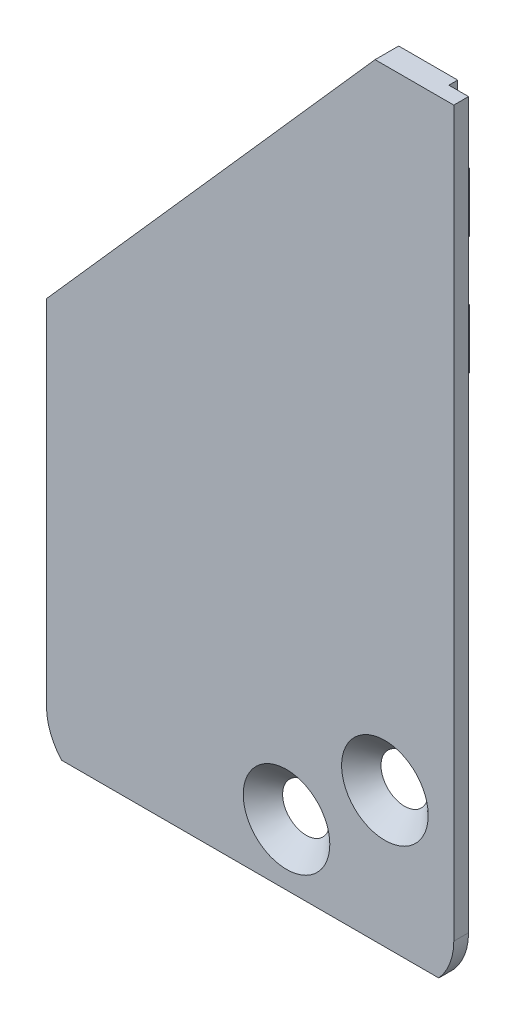
ISO-10303-21;
HEADER;
FILE_DESCRIPTION(('STEP AP214'),'2;1');
FILE_NAME('part.step','',(''),(''),'','','');
FILE_SCHEMA(('AUTOMOTIVE_DESIGN { 1 0 10303 214 1 1 1 1 }'));
ENDSEC;
DATA;
#1=APPLICATION_CONTEXT('core data for automotive mechanical design processes');
#2=APPLICATION_PROTOCOL_DEFINITION('international standard','automotive_design',2000,#1);
#3=PRODUCT_CONTEXT('',#1,'mechanical');
#4=PRODUCT('Part','Part','',(#3));
#5=PRODUCT_RELATED_PRODUCT_CATEGORY('part','',(#4));
#6=PRODUCT_DEFINITION_FORMATION('','',#4);
#7=PRODUCT_DEFINITION_CONTEXT('part definition',#1,'design');
#8=PRODUCT_DEFINITION('design','',#6,#7);
#9=PRODUCT_DEFINITION_SHAPE('','',#8);
#10=(LENGTH_UNIT() NAMED_UNIT(*) SI_UNIT(.MILLI.,.METRE.));
#11=(NAMED_UNIT(*) PLANE_ANGLE_UNIT() SI_UNIT($,.RADIAN.));
#12=(NAMED_UNIT(*) SI_UNIT($,.STERADIAN.) SOLID_ANGLE_UNIT());
#13=UNCERTAINTY_MEASURE_WITH_UNIT(LENGTH_MEASURE(1.E-05),#10,'distance_accuracy_value','');
#14=(GEOMETRIC_REPRESENTATION_CONTEXT(3) GLOBAL_UNCERTAINTY_ASSIGNED_CONTEXT((#13)) GLOBAL_UNIT_ASSIGNED_CONTEXT((#10,
#11,#12)) REPRESENTATION_CONTEXT('',''));
#15=CARTESIAN_POINT('',(0.,0.,0.));
#16=DIRECTION('',(0.,0.,1.));
#17=DIRECTION('',(1.,0.,0.));
#18=AXIS2_PLACEMENT_3D('',#15,#16,#17);
#19=CARTESIAN_POINT('',(13.2550598483893,0.,-0.8));
#20=DIRECTION('',(-1.,0.,0.));
#21=DIRECTION('',(0.,-1.,0.));
#22=AXIS2_PLACEMENT_3D('',#19,#20,#21);
#23=PLANE('',#22);
#24=DIRECTION('',(0.,1.,0.));
#25=VECTOR('',#24,1.);
#26=CARTESIAN_POINT('',(13.2550598483893,0.,0.25));
#27=LINE('',#26,#25);
#28=CARTESIAN_POINT('',(13.2550598483894,21.1086005393354,0.25));
#29=VERTEX_POINT('',#28);
#30=CARTESIAN_POINT('',(13.2550598484106,57.9086005393351,0.25));
#31=VERTEX_POINT('',#30);
#32=EDGE_CURVE('E251',#29,#31,#27,.T.);
#33=ORIENTED_EDGE('',*,*,#32,.F.);
#34=DIRECTION('',(0.,0.,1.));
#35=VECTOR('',#34,1.);
#36=CARTESIAN_POINT('',(13.2550598483894,21.1086005393354,-0.2));
#37=LINE('',#36,#35);
#38=CARTESIAN_POINT('',(13.2550598484169,21.1086005393354,0.));
#39=VERTEX_POINT('',#38);
#40=EDGE_CURVE('E368',#29,#39,#37,.F.);
#41=ORIENTED_EDGE('',*,*,#40,.T.);
#42=DIRECTION('',(0.,-1.,0.));
#43=VECTOR('',#42,1.);
#44=CARTESIAN_POINT('',(13.2550598484169,33.2336005393516,0.));
#45=LINE('',#44,#43);
#46=CARTESIAN_POINT('',(13.2550598484169,33.2336005393516,0.));
#47=VERTEX_POINT('',#46);
#48=EDGE_CURVE('E271',#47,#39,#45,.T.);
#49=ORIENTED_EDGE('',*,*,#48,.F.);
#50=DIRECTION('',(0.,0.,1.));
#51=VECTOR('',#50,1.);
#52=CARTESIAN_POINT('',(13.2550598484169,33.2336005393516,-0.2));
#53=LINE('',#52,#51);
#54=CARTESIAN_POINT('',(13.2550598484169,33.2336005393516,-0.2));
#55=VERTEX_POINT('',#54);
#56=EDGE_CURVE('E270',#55,#47,#53,.T.);
#57=ORIENTED_EDGE('',*,*,#56,.F.);
#58=DIRECTION('',(4.47585482422779E-13,1.,0.));
#59=VECTOR('',#58,1.);
#60=CARTESIAN_POINT('',(13.2550598484106,57.9086005393354,-0.2));
#61=LINE('',#60,#59);
#62=CARTESIAN_POINT('',(13.2550598483896,44.7336005393203,-0.2));
#63=VERTEX_POINT('',#62);
#64=EDGE_CURVE('E312',#55,#63,#61,.T.);
#65=ORIENTED_EDGE('',*,*,#64,.T.);
#66=DIRECTION('',(0.,0.,1.));
#67=VECTOR('',#66,1.);
#68=CARTESIAN_POINT('',(13.2550598483896,44.7336005393203,-0.8));
#69=LINE('',#68,#67);
#70=CARTESIAN_POINT('',(13.2550598483896,44.7336005393203,-0.8));
#71=VERTEX_POINT('',#70);
#72=EDGE_CURVE('E296',#71,#63,#69,.T.);
#73=ORIENTED_EDGE('',*,*,#72,.F.);
#74=DIRECTION('',(0.,-1.,0.));
#75=VECTOR('',#74,1.);
#76=CARTESIAN_POINT('',(13.2550598483894,0.,-0.8));
#77=LINE('',#76,#75);
#78=CARTESIAN_POINT('',(13.2550598483896,47.7336005393203,-0.8));
#79=VERTEX_POINT('',#78);
#80=EDGE_CURVE('E289',#79,#71,#77,.T.);
#81=ORIENTED_EDGE('',*,*,#80,.F.);
#82=DIRECTION('',(0.,0.,1.));
#83=VECTOR('',#82,1.);
#84=CARTESIAN_POINT('',(13.2550598483896,47.7336005393203,-0.8));
#85=LINE('',#84,#83);
#86=CARTESIAN_POINT('',(13.2550598483896,47.7336005393203,-0.2));
#87=VERTEX_POINT('',#86);
#88=EDGE_CURVE('E292',#79,#87,#85,.T.);
#89=ORIENTED_EDGE('',*,*,#88,.T.);
#90=CARTESIAN_POINT('',(13.2550598484074,50.7336005393203,-0.2));
#91=VERTEX_POINT('',#90);
#92=EDGE_CURVE('E315',#87,#91,#61,.T.);
#93=ORIENTED_EDGE('',*,*,#92,.T.);
#94=DIRECTION('',(0.,0.,1.));
#95=VECTOR('',#94,1.);
#96=CARTESIAN_POINT('',(13.2550598483896,50.7336005393203,-0.8));
#97=LINE('',#96,#95);
#98=CARTESIAN_POINT('',(13.2550598483896,50.7336005393203,-0.8));
#99=VERTEX_POINT('',#98);
#100=EDGE_CURVE('E346',#99,#91,#97,.T.);
#101=ORIENTED_EDGE('',*,*,#100,.F.);
#102=DIRECTION('',(0.,-1.,0.));
#103=VECTOR('',#102,1.);
#104=CARTESIAN_POINT('',(13.2550598483893,0.,-0.8));
#105=LINE('',#104,#103);
#106=CARTESIAN_POINT('',(13.2550598483896,53.7336005393203,-0.8));
#107=VERTEX_POINT('',#106);
#108=EDGE_CURVE('E339',#107,#99,#105,.T.);
#109=ORIENTED_EDGE('',*,*,#108,.F.);
#110=DIRECTION('',(0.,0.,1.));
#111=VECTOR('',#110,1.);
#112=CARTESIAN_POINT('',(13.2550598483896,53.7336005393203,-0.8));
#113=LINE('',#112,#111);
#114=CARTESIAN_POINT('',(13.2550598484087,53.7336005393203,-0.2));
#115=VERTEX_POINT('',#114);
#116=EDGE_CURVE('E342',#107,#115,#113,.T.);
#117=ORIENTED_EDGE('',*,*,#116,.T.);
#118=CARTESIAN_POINT('',(13.2550598484106,57.9086005393354,-0.2));
#119=VERTEX_POINT('',#118);
#120=EDGE_CURVE('E311',#115,#119,#61,.T.);
#121=ORIENTED_EDGE('',*,*,#120,.T.);
#122=DIRECTION('',(0.,0.,1.));
#123=VECTOR('',#122,1.);
#124=CARTESIAN_POINT('',(13.2550598484106,57.9086005393354,-0.2));
#125=LINE('',#124,#123);
#126=EDGE_CURVE('E320',#119,#31,#125,.T.);
#127=ORIENTED_EDGE('',*,*,#126,.T.);
#128=EDGE_LOOP('',(#33,#41,#49,#57,#65,#73,#81,#89,#93,#101,#109,#117,#121,#127));
#129=FACE_BOUND('',#128,.T.);
#130=ADVANCED_FACE('F39',(#129),#23,.F.);
#131=CARTESIAN_POINT('',(-3.44494015157294,21.1086005393354,-0.2));
#132=DIRECTION('',(0.,0.,1.));
#133=DIRECTION('',(1.,0.,0.));
#134=AXIS2_PLACEMENT_3D('',#131,#132,#133);
#135=CYLINDRICAL_SURFACE('',#134,2.);
#136=DIRECTION('',(0.,0.,1.));
#137=VECTOR('',#136,1.);
#138=CARTESIAN_POINT('',(-3.44494015157294,19.1086005393354,-0.2));
#139=LINE('',#138,#137);
#140=CARTESIAN_POINT('',(-3.44494015157294,19.1086005393354,0.25));
#141=VERTEX_POINT('',#140);
#142=CARTESIAN_POINT('',(-3.44494015157294,19.1086005393354,0.));
#143=VERTEX_POINT('',#142);
#144=EDGE_CURVE('E54',#141,#143,#139,.F.);
#145=ORIENTED_EDGE('',*,*,#144,.F.);
#146=CARTESIAN_POINT('',(-3.44494015157294,21.1086005393354,0.25));
#147=DIRECTION('',(0.,0.,1.));
#148=DIRECTION('',(1.,0.,0.));
#149=AXIS2_PLACEMENT_3D('',#146,#147,#148);
#150=CIRCLE('',#149,2.);
#151=CARTESIAN_POINT('',(-5.44494015157294,21.1086005393337,0.25));
#152=VERTEX_POINT('',#151);
#153=EDGE_CURVE('E264',#141,#152,#150,.F.);
#154=ORIENTED_EDGE('',*,*,#153,.T.);
#155=DIRECTION('',(0.,0.,1.));
#156=VECTOR('',#155,1.);
#157=CARTESIAN_POINT('',(-5.44494015157294,21.1086005393337,-0.2));
#158=LINE('',#157,#156);
#159=CARTESIAN_POINT('',(-5.44494015157294,21.1086005393337,-0.2));
#160=VERTEX_POINT('',#159);
#161=EDGE_CURVE('E371',#160,#152,#158,.T.);
#162=ORIENTED_EDGE('',*,*,#161,.F.);
#163=CARTESIAN_POINT('',(-3.44494015157294,21.1086005393354,-0.2));
#164=DIRECTION('',(0.,0.,1.));
#165=DIRECTION('',(1.,0.,0.));
#166=AXIS2_PLACEMENT_3D('',#163,#164,#165);
#167=CIRCLE('',#166,2.);
#168=CARTESIAN_POINT('',(-4.77480014960853,19.6147891772067,-0.2));
#169=VERTEX_POINT('',#168);
#170=EDGE_CURVE('E62',#169,#160,#167,.F.);
#171=ORIENTED_EDGE('',*,*,#170,.F.);
#172=DIRECTION('',(0.,0.,1.));
#173=VECTOR('',#172,1.);
#174=CARTESIAN_POINT('',(-4.77480014960853,19.6147891772067,-0.2));
#175=LINE('',#174,#173);
#176=CARTESIAN_POINT('',(-4.77480014960853,19.6147891772067,0.));
#177=VERTEX_POINT('',#176);
#178=EDGE_CURVE('E47',#169,#177,#175,.T.);
#179=ORIENTED_EDGE('',*,*,#178,.T.);
#180=CARTESIAN_POINT('',(-3.44494015157294,21.1086005393354,0.));
#181=DIRECTION('',(0.,0.,1.));
#182=DIRECTION('',(1.,0.,0.));
#183=AXIS2_PLACEMENT_3D('',#180,#181,#182);
#184=CIRCLE('',#183,2.);
#185=EDGE_CURVE('E374',#143,#177,#184,.F.);
#186=ORIENTED_EDGE('',*,*,#185,.F.);
#187=EDGE_LOOP('',(#145,#154,#162,#171,#179,#186));
#188=FACE_BOUND('',#187,.T.);
#189=ADVANCED_FACE('F41',(#188),#135,.T.);
#190=CARTESIAN_POINT('',(-5.44494015157122,19.1086005393354,-0.2));
#191=DIRECTION('',(-1.,-8.62794802471851E-13,0.));
#192=DIRECTION('',(8.62794802471851E-13,-1.,0.));
#193=AXIS2_PLACEMENT_3D('',#190,#191,#192);
#194=PLANE('',#193);
#195=ORIENTED_EDGE('',*,*,#161,.T.);
#196=DIRECTION('',(-8.62794802471851E-13,1.,0.));
#197=VECTOR('',#196,1.);
#198=CARTESIAN_POINT('',(-5.44494015157122,19.1086005393354,0.25));
#199=LINE('',#198,#197);
#200=CARTESIAN_POINT('',(-5.44494015158938,40.1684875449851,0.25));
#201=VERTEX_POINT('',#200);
#202=EDGE_CURVE('E262',#152,#201,#199,.T.);
#203=ORIENTED_EDGE('',*,*,#202,.T.);
#204=DIRECTION('',(0.,0.,1.));
#205=VECTOR('',#204,1.);
#206=CARTESIAN_POINT('',(-5.44494015158939,40.1684875449851,-0.2));
#207=LINE('',#206,#205);
#208=CARTESIAN_POINT('',(-5.44494015158939,40.1684875449851,-0.2));
#209=VERTEX_POINT('',#208);
#210=EDGE_CURVE('E205',#209,#201,#207,.T.);
#211=ORIENTED_EDGE('',*,*,#210,.F.);
#212=DIRECTION('',(8.62794802471851E-13,-1.,0.));
#213=VECTOR('',#212,1.);
#214=CARTESIAN_POINT('',(-5.44494015157122,19.1086005393354,-0.2));
#215=LINE('',#214,#213);
#216=EDGE_CURVE('E309',#209,#160,#215,.T.);
#217=ORIENTED_EDGE('',*,*,#216,.T.);
#218=EDGE_LOOP('',(#195,#203,#211,#217));
#219=FACE_BOUND('',#218,.T.);
#220=ADVANCED_FACE('F462',(#219),#194,.T.);
#221=CARTESIAN_POINT('',(11.2550598483894,21.1086005393354,-0.2));
#222=DIRECTION('',(0.,0.,-1.));
#223=DIRECTION('',(-1.,0.,0.));
#224=AXIS2_PLACEMENT_3D('',#221,#222,#223);
#225=CYLINDRICAL_SURFACE('',#224,2.);
#226=ORIENTED_EDGE('',*,*,#40,.F.);
#227=CARTESIAN_POINT('',(11.2550598483894,21.1086005393354,0.25));
#228=DIRECTION('',(0.,0.,1.));
#229=DIRECTION('',(1.,0.,0.));
#230=AXIS2_PLACEMENT_3D('',#227,#228,#229);
#231=CIRCLE('',#230,2.);
#232=CARTESIAN_POINT('',(11.2550598483894,19.1086005393354,0.25));
#233=VERTEX_POINT('',#232);
#234=EDGE_CURVE('E11',#29,#233,#231,.F.);
#235=ORIENTED_EDGE('',*,*,#234,.T.);
#236=DIRECTION('',(0.,0.,1.));
#237=VECTOR('',#236,1.);
#238=CARTESIAN_POINT('',(11.2550598483894,19.1086005393354,1.));
#239=LINE('',#238,#237);
#240=CARTESIAN_POINT('',(11.2550598483894,19.1086005393516,0.));
#241=VERTEX_POINT('',#240);
#242=EDGE_CURVE('E365',#241,#233,#239,.T.);
#243=ORIENTED_EDGE('',*,*,#242,.F.);
#244=CARTESIAN_POINT('',(11.2550598483894,21.1086005393354,0.));
#245=DIRECTION('',(0.,0.,1.));
#246=DIRECTION('',(1.,0.,0.));
#247=AXIS2_PLACEMENT_3D('',#244,#245,#246);
#248=CIRCLE('',#247,2.);
#249=EDGE_CURVE('E279',#39,#241,#248,.F.);
#250=ORIENTED_EDGE('',*,*,#249,.F.);
#251=EDGE_LOOP('',(#226,#235,#243,#250));
#252=FACE_BOUND('',#251,.T.);
#253=ADVANCED_FACE('F478',(#252),#225,.T.);
#254=CARTESIAN_POINT('',(0.,0.,-0.2));
#255=DIRECTION('',(0.,0.,1.));
#256=DIRECTION('',(1.,0.,0.));
#257=AXIS2_PLACEMENT_3D('',#254,#255,#256);
#258=PLANE('',#257);
#259=DIRECTION('',(0.797947132166137,0.602727446088062,0.));
#260=VECTOR('',#259,1.);
#261=CARTESIAN_POINT('',(-5.4449401515831,19.1086005393516,-0.2));
#262=LINE('',#261,#260);
#263=EDGE_CURVE('E268',#169,#55,#262,.T.);
#264=ORIENTED_EDGE('',*,*,#263,.F.);
#265=ORIENTED_EDGE('',*,*,#170,.T.);
#266=ORIENTED_EDGE('',*,*,#216,.F.);
#267=DIRECTION('',(-0.662735445157986,-0.748853610348008,0.));
#268=VECTOR('',#267,1.);
#269=CARTESIAN_POINT('',(10.2550598484106,57.9086005393354,-0.2));
#270=LINE('',#269,#268);
#271=CARTESIAN_POINT('',(10.2550598484106,57.9086005393354,-0.2));
#272=VERTEX_POINT('',#271);
#273=EDGE_CURVE('E318',#272,#209,#270,.T.);
#274=ORIENTED_EDGE('',*,*,#273,.F.);
#275=DIRECTION('',(-1.,0.,0.));
#276=VECTOR('',#275,1.);
#277=CARTESIAN_POINT('',(13.2550598484106,57.9086005393354,-0.2));
#278=LINE('',#277,#276);
#279=EDGE_CURVE('E314',#119,#272,#278,.T.);
#280=ORIENTED_EDGE('',*,*,#279,.F.);
#281=ORIENTED_EDGE('',*,*,#120,.F.);
#282=DIRECTION('',(-1.,0.,0.));
#283=VECTOR('',#282,1.);
#284=CARTESIAN_POINT('',(0.,53.7336005393203,-0.2));
#285=LINE('',#284,#283);
#286=CARTESIAN_POINT('',(11.2550598483896,53.7336005393203,-0.2));
#287=VERTEX_POINT('',#286);
#288=EDGE_CURVE('E329',#115,#287,#285,.T.);
#289=ORIENTED_EDGE('',*,*,#288,.T.);
#290=CARTESIAN_POINT('',(11.2550598483896,52.2336005393203,-0.2));
#291=DIRECTION('',(0.,0.,1.));
#292=DIRECTION('',(1.,0.,0.));
#293=AXIS2_PLACEMENT_3D('',#290,#291,#292);
#294=CIRCLE('',#293,1.5);
#295=CARTESIAN_POINT('',(11.2550598483896,50.7336005393203,-0.2));
#296=VERTEX_POINT('',#295);
#297=EDGE_CURVE('E345',#296,#287,#294,.F.);
#298=ORIENTED_EDGE('',*,*,#297,.F.);
#299=DIRECTION('',(1.,0.,0.));
#300=VECTOR('',#299,1.);
#301=CARTESIAN_POINT('',(0.,50.7336005393203,-0.2));
#302=LINE('',#301,#300);
#303=EDGE_CURVE('E322',#296,#91,#302,.T.);
#304=ORIENTED_EDGE('',*,*,#303,.T.);
#305=ORIENTED_EDGE('',*,*,#92,.F.);
#306=DIRECTION('',(1.,0.,0.));
#307=VECTOR('',#306,1.);
#308=CARTESIAN_POINT('',(0.,47.7336005393203,-0.2));
#309=LINE('',#308,#307);
#310=CARTESIAN_POINT('',(11.2550598483896,47.7336005393203,-0.2));
#311=VERTEX_POINT('',#310);
#312=EDGE_CURVE('E362',#311,#87,#309,.T.);
#313=ORIENTED_EDGE('',*,*,#312,.F.);
#314=CARTESIAN_POINT('',(11.2550598483896,46.2336005393203,-0.2));
#315=DIRECTION('',(0.,0.,1.));
#316=DIRECTION('',(1.,0.,0.));
#317=AXIS2_PLACEMENT_3D('',#314,#315,#316);
#318=CIRCLE('',#317,1.5);
#319=CARTESIAN_POINT('',(11.2550598483896,44.7336005393203,-0.2));
#320=VERTEX_POINT('',#319);
#321=EDGE_CURVE('E356',#311,#320,#318,.T.);
#322=ORIENTED_EDGE('',*,*,#321,.T.);
#323=DIRECTION('',(-1.,0.,0.));
#324=VECTOR('',#323,1.);
#325=CARTESIAN_POINT('',(0.,44.7336005393203,-0.2));
#326=LINE('',#325,#324);
#327=EDGE_CURVE('E359',#63,#320,#326,.T.);
#328=ORIENTED_EDGE('',*,*,#327,.F.);
#329=ORIENTED_EDGE('',*,*,#64,.F.);
#330=EDGE_LOOP('',(#264,#265,#266,#274,#280,#281,#289,#298,#304,#305,#313,#322,#328,#329));
#331=FACE_BOUND('',#330,.T.);
#332=ADVANCED_FACE('F384',(#331),#258,.F.);
#333=CARTESIAN_POINT('',(0.,53.7336005393203,-0.8));
#334=DIRECTION('',(0.,-1.,0.));
#335=DIRECTION('',(0.,0.,-1.));
#336=AXIS2_PLACEMENT_3D('',#333,#334,#335);
#337=PLANE('',#336);
#338=ORIENTED_EDGE('',*,*,#288,.F.);
#339=ORIENTED_EDGE('',*,*,#116,.F.);
#340=DIRECTION('',(1.,0.,0.));
#341=VECTOR('',#340,1.);
#342=CARTESIAN_POINT('',(0.,53.7336005393203,-0.8));
#343=LINE('',#342,#341);
#344=CARTESIAN_POINT('',(11.2550598483896,53.7336005393203,-0.8));
#345=VERTEX_POINT('',#344);
#346=EDGE_CURVE('E331',#345,#107,#343,.T.);
#347=ORIENTED_EDGE('',*,*,#346,.F.);
#348=DIRECTION('',(0.,0.,1.));
#349=VECTOR('',#348,1.);
#350=CARTESIAN_POINT('',(11.2550598483896,53.7336005393203,-0.8));
#351=LINE('',#350,#349);
#352=EDGE_CURVE('E341',#345,#287,#351,.T.);
#353=ORIENTED_EDGE('',*,*,#352,.T.);
#354=EDGE_LOOP('',(#338,#339,#347,#353));
#355=FACE_BOUND('',#354,.T.);
#356=ADVANCED_FACE('F471',(#355),#337,.F.);
#357=CARTESIAN_POINT('',(0.,50.7336005393203,-0.8));
#358=DIRECTION('',(0.,1.,0.));
#359=DIRECTION('',(0.,0.,1.));
#360=AXIS2_PLACEMENT_3D('',#357,#358,#359);
#361=PLANE('',#360);
#362=ORIENTED_EDGE('',*,*,#303,.F.);
#363=DIRECTION('',(0.,0.,1.));
#364=VECTOR('',#363,1.);
#365=CARTESIAN_POINT('',(11.2550598483896,50.7336005393203,-0.8));
#366=LINE('',#365,#364);
#367=CARTESIAN_POINT('',(11.2550598483896,50.7336005393203,-0.8));
#368=VERTEX_POINT('',#367);
#369=EDGE_CURVE('E349',#368,#296,#366,.T.);
#370=ORIENTED_EDGE('',*,*,#369,.F.);
#371=DIRECTION('',(-1.,0.,0.));
#372=VECTOR('',#371,1.);
#373=CARTESIAN_POINT('',(0.,50.7336005393203,-0.8));
#374=LINE('',#373,#372);
#375=EDGE_CURVE('E337',#99,#368,#374,.T.);
#376=ORIENTED_EDGE('',*,*,#375,.F.);
#377=ORIENTED_EDGE('',*,*,#100,.T.);
#378=EDGE_LOOP('',(#362,#370,#376,#377));
#379=FACE_BOUND('',#378,.T.);
#380=ADVANCED_FACE('F467',(#379),#361,.F.);
#381=CARTESIAN_POINT('',(11.2550598483896,52.2336005393203,-0.8));
#382=DIRECTION('',(0.,0.,1.));
#383=DIRECTION('',(1.,0.,0.));
#384=AXIS2_PLACEMENT_3D('',#381,#382,#383);
#385=CYLINDRICAL_SURFACE('',#384,1.5);
#386=ORIENTED_EDGE('',*,*,#369,.T.);
#387=ORIENTED_EDGE('',*,*,#297,.T.);
#388=ORIENTED_EDGE('',*,*,#352,.F.);
#389=CARTESIAN_POINT('',(11.2550598483896,52.2336005393203,-0.8));
#390=DIRECTION('',(0.,0.,1.));
#391=DIRECTION('',(1.,0.,0.));
#392=AXIS2_PLACEMENT_3D('',#389,#390,#391);
#393=CIRCLE('',#392,1.5);
#394=EDGE_CURVE('E334',#345,#368,#393,.T.);
#395=ORIENTED_EDGE('',*,*,#394,.T.);
#396=EDGE_LOOP('',(#386,#387,#388,#395));
#397=FACE_BOUND('',#396,.T.);
#398=ADVANCED_FACE('F470',(#397),#385,.T.);
#399=CARTESIAN_POINT('',(0.,0.,-0.8));
#400=DIRECTION('',(0.,0.,1.));
#401=DIRECTION('',(1.,0.,0.));
#402=AXIS2_PLACEMENT_3D('',#399,#400,#401);
#403=PLANE('',#402);
#404=ORIENTED_EDGE('',*,*,#346,.T.);
#405=ORIENTED_EDGE('',*,*,#108,.T.);
#406=ORIENTED_EDGE('',*,*,#375,.T.);
#407=ORIENTED_EDGE('',*,*,#394,.F.);
#408=EDGE_LOOP('',(#404,#405,#406,#407));
#409=FACE_BOUND('',#408,.T.);
#410=ADVANCED_FACE('F465',(#409),#403,.F.);
#411=CARTESIAN_POINT('',(10.2550598484106,57.9086005393354,-0.2));
#412=DIRECTION('',(-0.748853610348008,0.662735445157986,0.));
#413=DIRECTION('',(-0.662735445157986,-0.748853610348008,0.));
#414=AXIS2_PLACEMENT_3D('',#411,#412,#413);
#415=PLANE('',#414);
#416=DIRECTION('',(-0.662735445157986,-0.748853610348008,0.));
#417=VECTOR('',#416,1.);
#418=CARTESIAN_POINT('',(10.2550598484106,57.9086005393354,1.));
#419=LINE('',#418,#417);
#420=CARTESIAN_POINT('',(10.2550598484106,57.9086005393354,1.));
#421=VERTEX_POINT('',#420);
#422=CARTESIAN_POINT('',(-6.44494015158841,39.0385440421614,1.));
#423=VERTEX_POINT('',#422);
#424=EDGE_CURVE('E307',#421,#423,#419,.T.);
#425=ORIENTED_EDGE('',*,*,#424,.F.);
#426=DIRECTION('',(0.,0.,1.));
#427=VECTOR('',#426,1.);
#428=CARTESIAN_POINT('',(10.2550598484106,57.9086005393354,-0.2));
#429=LINE('',#428,#427);
#430=EDGE_CURVE('E323',#272,#421,#429,.T.);
#431=ORIENTED_EDGE('',*,*,#430,.F.);
#432=ORIENTED_EDGE('',*,*,#273,.T.);
#433=ORIENTED_EDGE('',*,*,#210,.T.);
#434=DIRECTION('',(-0.662735445157986,-0.748853610348008,0.));
#435=VECTOR('',#434,1.);
#436=CARTESIAN_POINT('',(10.2550598484106,57.9086005393354,0.25));
#437=LINE('',#436,#435);
#438=CARTESIAN_POINT('',(-6.44494015158841,39.0385440421614,0.25));
#439=VERTEX_POINT('',#438);
#440=EDGE_CURVE('E198',#201,#439,#437,.T.);
#441=ORIENTED_EDGE('',*,*,#440,.T.);
#442=DIRECTION('',(0.,0.,1.));
#443=VECTOR('',#442,1.);
#444=CARTESIAN_POINT('',(-6.44494015158841,39.0385440421614,0.25));
#445=LINE('',#444,#443);
#446=EDGE_CURVE('E202',#439,#423,#445,.T.);
#447=ORIENTED_EDGE('',*,*,#446,.T.);
#448=EDGE_LOOP('',(#425,#431,#432,#433,#441,#447));
#449=FACE_BOUND('',#448,.T.);
#450=ADVANCED_FACE('F201',(#449),#415,.T.);
#451=CARTESIAN_POINT('',(13.2550598484106,57.9086005393354,-0.2));
#452=DIRECTION('',(0.,1.,0.));
#453=DIRECTION('',(-1.,0.,0.));
#454=AXIS2_PLACEMENT_3D('',#451,#452,#453);
#455=PLANE('',#454);
#456=DIRECTION('',(-1.,0.,0.));
#457=VECTOR('',#456,1.);
#458=CARTESIAN_POINT('',(13.2550598484106,57.9086005393354,1.));
#459=LINE('',#458,#457);
#460=CARTESIAN_POINT('',(14.2550598484106,57.908600539335,1.));
#461=VERTEX_POINT('',#460);
#462=EDGE_CURVE('E304',#461,#421,#459,.T.);
#463=ORIENTED_EDGE('',*,*,#462,.F.);
#464=DIRECTION('',(0.,0.,1.));
#465=VECTOR('',#464,1.);
#466=CARTESIAN_POINT('',(14.2550598484106,57.908600539335,0.25));
#467=LINE('',#466,#465);
#468=CARTESIAN_POINT('',(14.2550598484106,57.908600539335,0.25));
#469=VERTEX_POINT('',#468);
#470=EDGE_CURVE('E248',#469,#461,#467,.T.);
#471=ORIENTED_EDGE('',*,*,#470,.F.);
#472=DIRECTION('',(-1.,1.12757025938492E-13,0.));
#473=VECTOR('',#472,1.);
#474=CARTESIAN_POINT('',(14.2550598484106,57.908600539335,0.25));
#475=LINE('',#474,#473);
#476=EDGE_CURVE('E210',#469,#31,#475,.T.);
#477=ORIENTED_EDGE('',*,*,#476,.T.);
#478=ORIENTED_EDGE('',*,*,#126,.F.);
#479=ORIENTED_EDGE('',*,*,#279,.T.);
#480=ORIENTED_EDGE('',*,*,#430,.T.);
#481=EDGE_LOOP('',(#463,#471,#477,#478,#479,#480));
#482=FACE_BOUND('',#481,.T.);
#483=ADVANCED_FACE('F410',(#482),#455,.T.);
#484=CARTESIAN_POINT('',(-5.44494015157122,19.1086005393354,-0.2));
#485=DIRECTION('',(0.,-1.,0.));
#486=DIRECTION('',(0.,0.,-1.));
#487=AXIS2_PLACEMENT_3D('',#484,#485,#486);
#488=PLANE('',#487);
#489=DIRECTION('',(1.,0.,0.));
#490=VECTOR('',#489,1.);
#491=CARTESIAN_POINT('',(-5.44494015157122,19.1086005393354,1.));
#492=LINE('',#491,#490);
#493=CARTESIAN_POINT('',(-5.68100812907274,19.1086005393354,1.));
#494=VERTEX_POINT('',#493);
#495=CARTESIAN_POINT('',(13.4911278258944,19.108600539335,1.));
#496=VERTEX_POINT('',#495);
#497=EDGE_CURVE('E295',#494,#496,#492,.T.);
#498=ORIENTED_EDGE('',*,*,#497,.F.);
#499=DIRECTION('',(0.,0.,1.));
#500=VECTOR('',#499,1.);
#501=CARTESIAN_POINT('',(-5.68100812907274,19.1086005393354,0.25));
#502=LINE('',#501,#500);
#503=CARTESIAN_POINT('',(-5.68100812907274,19.1086005393354,0.25));
#504=VERTEX_POINT('',#503);
#505=EDGE_CURVE('E257',#504,#494,#502,.T.);
#506=ORIENTED_EDGE('',*,*,#505,.F.);
#507=DIRECTION('',(1.,0.,0.));
#508=VECTOR('',#507,1.);
#509=CARTESIAN_POINT('',(-5.68100812907274,19.1086005393354,0.25));
#510=LINE('',#509,#508);
#511=EDGE_CURVE('E230',#504,#141,#510,.T.);
#512=ORIENTED_EDGE('',*,*,#511,.T.);
#513=ORIENTED_EDGE('',*,*,#144,.T.);
#514=DIRECTION('',(-1.,0.,0.));
#515=VECTOR('',#514,1.);
#516=CARTESIAN_POINT('',(13.2550598484169,19.1086005393516,0.));
#517=LINE('',#516,#515);
#518=EDGE_CURVE('E267',#241,#143,#517,.T.);
#519=ORIENTED_EDGE('',*,*,#518,.F.);
#520=ORIENTED_EDGE('',*,*,#242,.T.);
#521=CARTESIAN_POINT('',(13.4911278258944,19.108600539335,0.25));
#522=VERTEX_POINT('',#521);
#523=EDGE_CURVE('E226',#233,#522,#510,.T.);
#524=ORIENTED_EDGE('',*,*,#523,.T.);
#525=DIRECTION('',(0.,0.,1.));
#526=VECTOR('',#525,1.);
#527=CARTESIAN_POINT('',(13.4911278258944,19.108600539335,0.25));
#528=LINE('',#527,#526);
#529=EDGE_CURVE('E254',#522,#496,#528,.T.);
#530=ORIENTED_EDGE('',*,*,#529,.T.);
#531=EDGE_LOOP('',(#498,#506,#512,#513,#519,#520,#524,#530));
#532=FACE_BOUND('',#531,.T.);
#533=ADVANCED_FACE('F441',(#532),#488,.T.);
#534=CARTESIAN_POINT('',(0.,0.,1.));
#535=DIRECTION('',(0.,0.,1.));
#536=DIRECTION('',(1.,0.,0.));
#537=AXIS2_PLACEMENT_3D('',#534,#535,#536);
#538=PLANE('',#537);
#539=CARTESIAN_POINT('',(10.7550598483895,25.9969695232775,1.));
#540=DIRECTION('',(0.,0.,1.));
#541=DIRECTION('',(1.,0.,0.));
#542=AXIS2_PLACEMENT_3D('',#539,#540,#541);
#543=CIRCLE('',#542,2.2);
#544=CARTESIAN_POINT('',(12.9550598483895,25.9969695232775,1.));
#545=VERTEX_POINT('',#544);
#546=EDGE_CURVE('E432',#545,#545,#543,.T.);
#547=ORIENTED_EDGE('',*,*,#546,.F.);
#548=EDGE_LOOP('',(#547));
#549=FACE_BOUND('',#548,.T.);
#550=CARTESIAN_POINT('',(5.75505984838954,22.2202315553631,1.));
#551=DIRECTION('',(0.,0.,1.));
#552=DIRECTION('',(1.,0.,0.));
#553=AXIS2_PLACEMENT_3D('',#550,#551,#552);
#554=CIRCLE('',#553,2.2);
#555=CARTESIAN_POINT('',(7.95505984838954,22.2202315553631,1.));
#556=VERTEX_POINT('',#555);
#557=EDGE_CURVE('E426',#556,#556,#554,.T.);
#558=ORIENTED_EDGE('',*,*,#557,.F.);
#559=EDGE_LOOP('',(#558));
#560=FACE_BOUND('',#559,.T.);
#561=DIRECTION('',(4.47586940336951E-13,1.,0.));
#562=VECTOR('',#561,1.);
#563=CARTESIAN_POINT('',(14.2550598483941,21.108600539335,1.));
#564=LINE('',#563,#562);
#565=CARTESIAN_POINT('',(14.2550598483941,21.108600539335,1.));
#566=VERTEX_POINT('',#565);
#567=EDGE_CURVE('E245',#566,#461,#564,.T.);
#568=ORIENTED_EDGE('',*,*,#567,.T.);
#569=ORIENTED_EDGE('',*,*,#462,.T.);
#570=ORIENTED_EDGE('',*,*,#424,.T.);
#571=DIRECTION('',(8.62623717100349E-13,-1.,0.));
#572=VECTOR('',#571,1.);
#573=CARTESIAN_POINT('',(-6.44494015158841,39.0385440421614,1.));
#574=LINE('',#573,#572);
#575=CARTESIAN_POINT('',(-6.44494015157295,21.1086005393328,1.));
#576=VERTEX_POINT('',#575);
#577=EDGE_CURVE('E216',#423,#576,#574,.T.);
#578=ORIENTED_EDGE('',*,*,#577,.T.);
#579=CARTESIAN_POINT('',(-3.44494015157294,21.1086005393354,1.));
#580=DIRECTION('',(0.,0.,1.));
#581=DIRECTION('',(1.,0.,0.));
#582=AXIS2_PLACEMENT_3D('',#579,#580,#581);
#583=CIRCLE('',#582,3.);
#584=EDGE_CURVE('E238',#576,#494,#583,.T.);
#585=ORIENTED_EDGE('',*,*,#584,.T.);
#586=ORIENTED_EDGE('',*,*,#497,.T.);
#587=CARTESIAN_POINT('',(11.2550598483894,21.1086005393354,1.));
#588=DIRECTION('',(0.,0.,1.));
#589=DIRECTION('',(1.,0.,0.));
#590=AXIS2_PLACEMENT_3D('',#587,#588,#589);
#591=CIRCLE('',#590,3.00000000000414);
#592=EDGE_CURVE('E242',#496,#566,#591,.T.);
#593=ORIENTED_EDGE('',*,*,#592,.T.);
#594=EDGE_LOOP('',(#568,#569,#570,#578,#585,#586,#593));
#595=FACE_BOUND('',#594,.T.);
#596=ADVANCED_FACE('F414',(#549,#560,#595),#538,.T.);
#597=CARTESIAN_POINT('',(0.,47.7336005393203,-0.8));
#598=DIRECTION('',(0.,-1.,0.));
#599=DIRECTION('',(0.,0.,-1.));
#600=AXIS2_PLACEMENT_3D('',#597,#598,#599);
#601=PLANE('',#600);
#602=DIRECTION('',(0.,0.,1.));
#603=VECTOR('',#602,1.);
#604=CARTESIAN_POINT('',(11.2550598483896,47.7336005393203,-0.8));
#605=LINE('',#604,#603);
#606=CARTESIAN_POINT('',(11.2550598483896,47.7336005393203,-0.8));
#607=VERTEX_POINT('',#606);
#608=EDGE_CURVE('E291',#607,#311,#605,.T.);
#609=ORIENTED_EDGE('',*,*,#608,.T.);
#610=ORIENTED_EDGE('',*,*,#312,.T.);
#611=ORIENTED_EDGE('',*,*,#88,.F.);
#612=DIRECTION('',(1.,0.,0.));
#613=VECTOR('',#612,1.);
#614=CARTESIAN_POINT('',(0.,47.7336005393203,-0.8));
#615=LINE('',#614,#613);
#616=EDGE_CURVE('E281',#607,#79,#615,.T.);
#617=ORIENTED_EDGE('',*,*,#616,.F.);
#618=EDGE_LOOP('',(#609,#610,#611,#617));
#619=FACE_BOUND('',#618,.T.);
#620=ADVANCED_FACE('F440',(#619),#601,.F.);
#621=CARTESIAN_POINT('',(0.,44.7336005393203,-0.8));
#622=DIRECTION('',(0.,1.,0.));
#623=DIRECTION('',(0.,0.,1.));
#624=AXIS2_PLACEMENT_3D('',#621,#622,#623);
#625=PLANE('',#624);
#626=ORIENTED_EDGE('',*,*,#72,.T.);
#627=ORIENTED_EDGE('',*,*,#327,.T.);
#628=DIRECTION('',(0.,0.,1.));
#629=VECTOR('',#628,1.);
#630=CARTESIAN_POINT('',(11.2550598483896,44.7336005393203,-0.8));
#631=LINE('',#630,#629);
#632=CARTESIAN_POINT('',(11.2550598483896,44.7336005393203,-0.8));
#633=VERTEX_POINT('',#632);
#634=EDGE_CURVE('E299',#633,#320,#631,.T.);
#635=ORIENTED_EDGE('',*,*,#634,.F.);
#636=DIRECTION('',(-1.,0.,0.));
#637=VECTOR('',#636,1.);
#638=CARTESIAN_POINT('',(0.,44.7336005393203,-0.8));
#639=LINE('',#638,#637);
#640=EDGE_CURVE('E287',#71,#633,#639,.T.);
#641=ORIENTED_EDGE('',*,*,#640,.F.);
#642=EDGE_LOOP('',(#626,#627,#635,#641));
#643=FACE_BOUND('',#642,.T.);
#644=ADVANCED_FACE('F392',(#643),#625,.F.);
#645=CARTESIAN_POINT('',(11.2550598483896,46.2336005393203,-0.8));
#646=DIRECTION('',(0.,0.,1.));
#647=DIRECTION('',(1.,0.,0.));
#648=AXIS2_PLACEMENT_3D('',#645,#646,#647);
#649=CYLINDRICAL_SURFACE('',#648,1.5);
#650=ORIENTED_EDGE('',*,*,#321,.F.);
#651=ORIENTED_EDGE('',*,*,#608,.F.);
#652=CARTESIAN_POINT('',(11.2550598483896,46.2336005393203,-0.8));
#653=DIRECTION('',(0.,0.,1.));
#654=DIRECTION('',(1.,0.,0.));
#655=AXIS2_PLACEMENT_3D('',#652,#653,#654);
#656=CIRCLE('',#655,1.5);
#657=EDGE_CURVE('E284',#607,#633,#656,.T.);
#658=ORIENTED_EDGE('',*,*,#657,.T.);
#659=ORIENTED_EDGE('',*,*,#634,.T.);
#660=EDGE_LOOP('',(#650,#651,#658,#659));
#661=FACE_BOUND('',#660,.T.);
#662=ADVANCED_FACE('F516',(#661),#649,.T.);
#663=CARTESIAN_POINT('',(0.,0.,-0.8));
#664=DIRECTION('',(0.,0.,1.));
#665=DIRECTION('',(1.,0.,0.));
#666=AXIS2_PLACEMENT_3D('',#663,#664,#665);
#667=PLANE('',#666);
#668=ORIENTED_EDGE('',*,*,#616,.T.);
#669=ORIENTED_EDGE('',*,*,#80,.T.);
#670=ORIENTED_EDGE('',*,*,#640,.T.);
#671=ORIENTED_EDGE('',*,*,#657,.F.);
#672=EDGE_LOOP('',(#668,#669,#670,#671));
#673=FACE_BOUND('',#672,.T.);
#674=ADVANCED_FACE('F396',(#673),#667,.F.);
#675=CARTESIAN_POINT('',(-3.44494015158311,20.6192957265174,-0.2));
#676=DIRECTION('',(0.602727446088061,-0.797947132166138,0.));
#677=DIRECTION('',(0.797947132166138,0.602727446088061,0.));
#678=AXIS2_PLACEMENT_3D('',#675,#676,#677);
#679=PLANE('',#678);
#680=ORIENTED_EDGE('',*,*,#263,.T.);
#681=ORIENTED_EDGE('',*,*,#56,.T.);
#682=DIRECTION('',(0.797947132166138,0.602727446088061,0.));
#683=VECTOR('',#682,1.);
#684=CARTESIAN_POINT('',(-3.44494015158311,20.6192957265174,0.));
#685=LINE('',#684,#683);
#686=EDGE_CURVE('E273',#177,#47,#685,.T.);
#687=ORIENTED_EDGE('',*,*,#686,.F.);
#688=ORIENTED_EDGE('',*,*,#178,.F.);
#689=EDGE_LOOP('',(#680,#681,#687,#688));
#690=FACE_BOUND('',#689,.T.);
#691=ADVANCED_FACE('F381',(#690),#679,.T.);
#692=CARTESIAN_POINT('',(0.,0.,0.));
#693=DIRECTION('',(0.,0.,1.));
#694=DIRECTION('',(1.,0.,0.));
#695=AXIS2_PLACEMENT_3D('',#692,#693,#694);
#696=PLANE('',#695);
#697=CARTESIAN_POINT('',(10.7550598483895,25.9969695232775,0.));
#698=DIRECTION('',(0.,0.,1.));
#699=DIRECTION('',(1.,0.,0.));
#700=AXIS2_PLACEMENT_3D('',#697,#698,#699);
#701=CIRCLE('',#700,1.2);
#702=CARTESIAN_POINT('',(11.9550598483895,25.9969695232775,0.));
#703=VERTEX_POINT('',#702);
#704=EDGE_CURVE('E429',#703,#703,#701,.T.);
#705=ORIENTED_EDGE('',*,*,#704,.T.);
#706=EDGE_LOOP('',(#705));
#707=FACE_BOUND('',#706,.T.);
#708=CARTESIAN_POINT('',(5.75505984838954,22.2202315553631,0.));
#709=DIRECTION('',(0.,0.,1.));
#710=DIRECTION('',(1.,0.,0.));
#711=AXIS2_PLACEMENT_3D('',#708,#709,#710);
#712=CIRCLE('',#711,1.2);
#713=CARTESIAN_POINT('',(6.95505984838954,22.2202315553631,0.));
#714=VERTEX_POINT('',#713);
#715=EDGE_CURVE('E239',#714,#714,#712,.T.);
#716=ORIENTED_EDGE('',*,*,#715,.T.);
#717=EDGE_LOOP('',(#716));
#718=FACE_BOUND('',#717,.T.);
#719=ORIENTED_EDGE('',*,*,#249,.T.);
#720=ORIENTED_EDGE('',*,*,#518,.T.);
#721=ORIENTED_EDGE('',*,*,#185,.T.);
#722=ORIENTED_EDGE('',*,*,#686,.T.);
#723=ORIENTED_EDGE('',*,*,#48,.T.);
#724=EDGE_LOOP('',(#719,#720,#721,#722,#723));
#725=FACE_BOUND('',#724,.T.);
#726=ADVANCED_FACE('F491',(#707,#718,#725),#696,.F.);
#727=CARTESIAN_POINT('',(14.2550598483941,21.108600539335,0.25));
#728=DIRECTION('',(1.,-4.47586940336951E-13,0.));
#729=DIRECTION('',(4.47586940336951E-13,1.,0.));
#730=AXIS2_PLACEMENT_3D('',#727,#728,#729);
#731=PLANE('',#730);
#732=ORIENTED_EDGE('',*,*,#567,.F.);
#733=DIRECTION('',(0.,0.,1.));
#734=VECTOR('',#733,1.);
#735=CARTESIAN_POINT('',(14.2550598483941,21.108600539335,0.25));
#736=LINE('',#735,#734);
#737=CARTESIAN_POINT('',(14.2550598483941,21.108600539335,0.25));
#738=VERTEX_POINT('',#737);
#739=EDGE_CURVE('E252',#738,#566,#736,.T.);
#740=ORIENTED_EDGE('',*,*,#739,.F.);
#741=DIRECTION('',(4.47586940336951E-13,1.,0.));
#742=VECTOR('',#741,1.);
#743=CARTESIAN_POINT('',(14.2550598483941,21.108600539335,0.25));
#744=LINE('',#743,#742);
#745=EDGE_CURVE('E218',#738,#469,#744,.T.);
#746=ORIENTED_EDGE('',*,*,#745,.T.);
#747=ORIENTED_EDGE('',*,*,#470,.T.);
#748=EDGE_LOOP('',(#732,#740,#746,#747));
#749=FACE_BOUND('',#748,.T.);
#750=ADVANCED_FACE('F418',(#749),#731,.T.);
#751=CARTESIAN_POINT('',(11.2550598483894,21.1086005393354,0.25));
#752=DIRECTION('',(0.,0.,1.));
#753=DIRECTION('',(1.,0.,0.));
#754=AXIS2_PLACEMENT_3D('',#751,#752,#753);
#755=CYLINDRICAL_SURFACE('',#754,3.00000000000414);
#756=ORIENTED_EDGE('',*,*,#592,.F.);
#757=ORIENTED_EDGE('',*,*,#529,.F.);
#758=CARTESIAN_POINT('',(11.2550598483894,21.1086005393354,0.25));
#759=DIRECTION('',(0.,0.,1.));
#760=DIRECTION('',(1.,0.,0.));
#761=AXIS2_PLACEMENT_3D('',#758,#759,#760);
#762=CIRCLE('',#761,3.00000000000414);
#763=EDGE_CURVE('E232',#522,#738,#762,.T.);
#764=ORIENTED_EDGE('',*,*,#763,.T.);
#765=ORIENTED_EDGE('',*,*,#739,.T.);
#766=EDGE_LOOP('',(#756,#757,#764,#765));
#767=FACE_BOUND('',#766,.T.);
#768=ADVANCED_FACE('F494',(#767),#755,.T.);
#769=CARTESIAN_POINT('',(-3.44494015157294,21.1086005393354,0.25));
#770=DIRECTION('',(0.,0.,1.));
#771=DIRECTION('',(1.,0.,0.));
#772=AXIS2_PLACEMENT_3D('',#769,#770,#771);
#773=PLANE('',#772);
#774=ORIENTED_EDGE('',*,*,#234,.F.);
#775=ORIENTED_EDGE('',*,*,#32,.T.);
#776=ORIENTED_EDGE('',*,*,#476,.F.);
#777=ORIENTED_EDGE('',*,*,#745,.F.);
#778=ORIENTED_EDGE('',*,*,#763,.F.);
#779=ORIENTED_EDGE('',*,*,#523,.F.);
#780=EDGE_LOOP('',(#774,#775,#776,#777,#778,#779));
#781=FACE_BOUND('',#780,.T.);
#782=ADVANCED_FACE('F421',(#781),#773,.F.);
#783=CARTESIAN_POINT('',(-3.44494015157294,21.1086005393354,0.25));
#784=DIRECTION('',(0.,0.,1.));
#785=DIRECTION('',(1.,0.,0.));
#786=AXIS2_PLACEMENT_3D('',#783,#784,#785);
#787=CYLINDRICAL_SURFACE('',#786,3.);
#788=ORIENTED_EDGE('',*,*,#584,.F.);
#789=DIRECTION('',(0.,0.,1.));
#790=VECTOR('',#789,1.);
#791=CARTESIAN_POINT('',(-6.44494015157295,21.1086005393328,0.25));
#792=LINE('',#791,#790);
#793=CARTESIAN_POINT('',(-6.44494015157295,21.1086005393328,0.25));
#794=VERTEX_POINT('',#793);
#795=EDGE_CURVE('E217',#794,#576,#792,.T.);
#796=ORIENTED_EDGE('',*,*,#795,.F.);
#797=CARTESIAN_POINT('',(-3.44494015157294,21.1086005393354,0.25));
#798=DIRECTION('',(0.,0.,1.));
#799=DIRECTION('',(1.,0.,0.));
#800=AXIS2_PLACEMENT_3D('',#797,#798,#799);
#801=CIRCLE('',#800,3.);
#802=EDGE_CURVE('E224',#794,#504,#801,.T.);
#803=ORIENTED_EDGE('',*,*,#802,.T.);
#804=ORIENTED_EDGE('',*,*,#505,.T.);
#805=EDGE_LOOP('',(#788,#796,#803,#804));
#806=FACE_BOUND('',#805,.T.);
#807=ADVANCED_FACE('F501',(#806),#787,.T.);
#808=CARTESIAN_POINT('',(-6.44494015158841,39.0385440421614,0.25));
#809=DIRECTION('',(-1.,-8.62623717100349E-13,0.));
#810=DIRECTION('',(8.62623717100349E-13,-1.,0.));
#811=AXIS2_PLACEMENT_3D('',#808,#809,#810);
#812=PLANE('',#811);
#813=ORIENTED_EDGE('',*,*,#577,.F.);
#814=ORIENTED_EDGE('',*,*,#446,.F.);
#815=DIRECTION('',(8.62623717100349E-13,-1.,0.));
#816=VECTOR('',#815,1.);
#817=CARTESIAN_POINT('',(-6.44494015158841,39.0385440421614,0.25));
#818=LINE('',#817,#816);
#819=EDGE_CURVE('E209',#439,#794,#818,.T.);
#820=ORIENTED_EDGE('',*,*,#819,.T.);
#821=ORIENTED_EDGE('',*,*,#795,.T.);
#822=EDGE_LOOP('',(#813,#814,#820,#821));
#823=FACE_BOUND('',#822,.T.);
#824=ADVANCED_FACE('F214',(#823),#812,.T.);
#825=ORIENTED_EDGE('',*,*,#153,.F.);
#826=ORIENTED_EDGE('',*,*,#511,.F.);
#827=ORIENTED_EDGE('',*,*,#802,.F.);
#828=ORIENTED_EDGE('',*,*,#819,.F.);
#829=ORIENTED_EDGE('',*,*,#440,.F.);
#830=ORIENTED_EDGE('',*,*,#202,.F.);
#831=EDGE_LOOP('',(#825,#826,#827,#828,#829,#830));
#832=FACE_BOUND('',#831,.T.);
#833=ADVANCED_FACE('F221',(#832),#773,.F.);
#834=CARTESIAN_POINT('',(5.75505984838954,22.2202315553631,1.));
#835=DIRECTION('',(0.,0.,1.));
#836=DIRECTION('',(1.,0.,0.));
#837=AXIS2_PLACEMENT_3D('',#834,#835,#836);
#838=CONICAL_SURFACE('',#837,2.2,0.785398163397448);
#839=ORIENTED_EDGE('',*,*,#715,.F.);
#840=EDGE_LOOP('',(#839));
#841=FACE_BOUND('',#840,.T.);
#842=ORIENTED_EDGE('',*,*,#557,.T.);
#843=EDGE_LOOP('',(#842));
#844=FACE_BOUND('',#843,.T.);
#845=ADVANCED_FACE('F445',(#841,#844),#838,.F.);
#846=CARTESIAN_POINT('',(10.7550598483895,25.9969695232775,1.));
#847=DIRECTION('',(0.,0.,1.));
#848=DIRECTION('',(1.,0.,0.));
#849=AXIS2_PLACEMENT_3D('',#846,#847,#848);
#850=CONICAL_SURFACE('',#849,2.2,0.785398163397448);
#851=ORIENTED_EDGE('',*,*,#704,.F.);
#852=EDGE_LOOP('',(#851));
#853=FACE_BOUND('',#852,.T.);
#854=ORIENTED_EDGE('',*,*,#546,.T.);
#855=EDGE_LOOP('',(#854));
#856=FACE_BOUND('',#855,.T.);
#857=ADVANCED_FACE('F436',(#853,#856),#850,.F.);
#858=CLOSED_SHELL('',(#130,#189,#220,#253,#332,#356,#380,#398,#410,#450,#483,#533,#596,#620,
#644,#662,#674,#691,#726,#750,#768,#782,#807,#824,#833,#845,#857));
#859=MANIFOLD_SOLID_BREP('B2',#858);
#860=ADVANCED_BREP_SHAPE_REPRESENTATION('',(#18,#859),#14);
#861=SHAPE_DEFINITION_REPRESENTATION(#9,#860);
ENDSEC;
END-ISO-10303-21;
